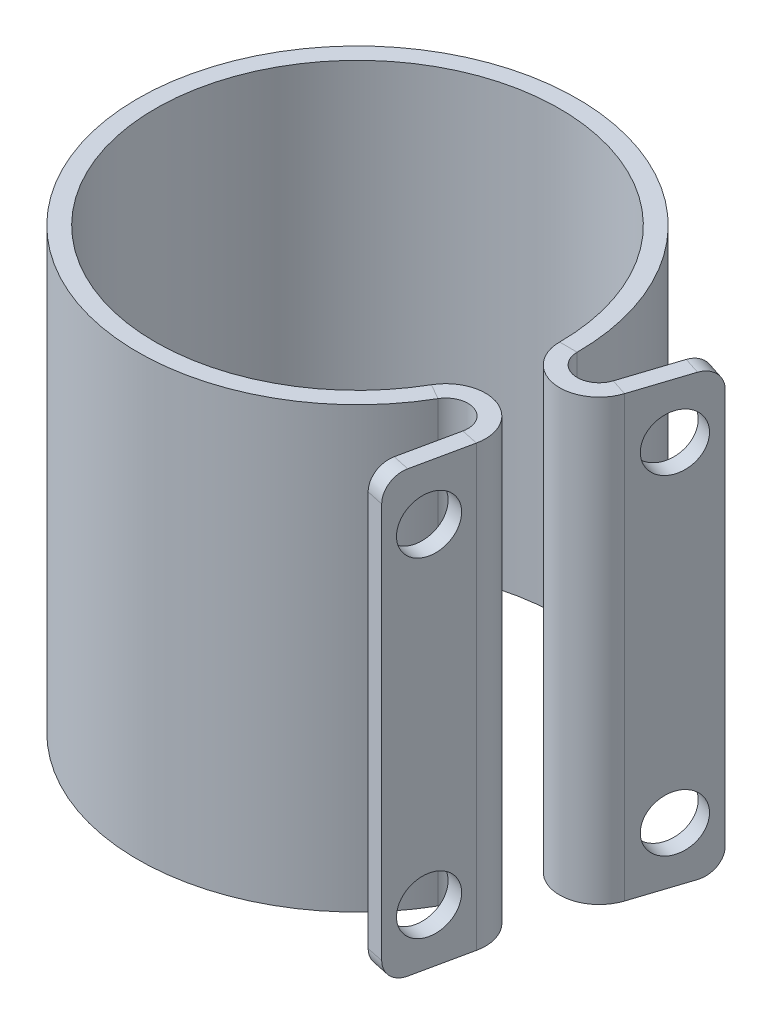
ISO-10303-21;
HEADER;
FILE_DESCRIPTION(('STEP AP214'),'2;1');
FILE_NAME('part.step','',(''),(''),'','','');
FILE_SCHEMA(('AUTOMOTIVE_DESIGN { 1 0 10303 214 1 1 1 1 }'));
ENDSEC;
DATA;
#1=APPLICATION_CONTEXT('core data for automotive mechanical design processes');
#2=APPLICATION_PROTOCOL_DEFINITION('international standard','automotive_design',2000,#1);
#3=PRODUCT_CONTEXT('',#1,'mechanical');
#4=PRODUCT('Part','Part','',(#3));
#5=PRODUCT_RELATED_PRODUCT_CATEGORY('part','',(#4));
#6=PRODUCT_DEFINITION_FORMATION('','',#4);
#7=PRODUCT_DEFINITION_CONTEXT('part definition',#1,'design');
#8=PRODUCT_DEFINITION('design','',#6,#7);
#9=PRODUCT_DEFINITION_SHAPE('','',#8);
#10=(LENGTH_UNIT() NAMED_UNIT(*) SI_UNIT(.MILLI.,.METRE.));
#11=(NAMED_UNIT(*) PLANE_ANGLE_UNIT() SI_UNIT($,.RADIAN.));
#12=(NAMED_UNIT(*) SI_UNIT($,.STERADIAN.) SOLID_ANGLE_UNIT());
#13=UNCERTAINTY_MEASURE_WITH_UNIT(LENGTH_MEASURE(1.E-05),#10,'distance_accuracy_value','');
#14=(GEOMETRIC_REPRESENTATION_CONTEXT(3) GLOBAL_UNCERTAINTY_ASSIGNED_CONTEXT((#13)) GLOBAL_UNIT_ASSIGNED_CONTEXT((#10,
#11,#12)) REPRESENTATION_CONTEXT('',''));
#15=CARTESIAN_POINT('',(0.,0.,0.));
#16=DIRECTION('',(0.,0.,1.));
#17=DIRECTION('',(1.,0.,0.));
#18=AXIS2_PLACEMENT_3D('',#15,#16,#17);
#19=CARTESIAN_POINT('',(0.,40.,0.));
#20=DIRECTION('',(0.,-1.,0.));
#21=DIRECTION('',(1.,0.,0.));
#22=AXIS2_PLACEMENT_3D('',#19,#20,#21);
#23=PLANE('',#22);
#24=DIRECTION('',(0.866025403784445,0.,0.499999999999989));
#25=VECTOR('',#24,1.);
#26=CARTESIAN_POINT('',(7.51812130120628,40.,4.34058935705157));
#27=LINE('',#26,#25);
#28=CARTESIAN_POINT('',(15.9348674296333,39.9999999999999,9.19999999999953));
#29=VERTEX_POINT('',#28);
#30=CARTESIAN_POINT('',(17.3205080756884,39.9999999999999,9.9999999999995));
#31=VERTEX_POINT('',#30);
#32=EDGE_CURVE('E323',#29,#31,#27,.T.);
#33=ORIENTED_EDGE('',*,*,#32,.F.);
#34=CARTESIAN_POINT('',(0.,40.,0.));
#35=DIRECTION('',(0.,1.,0.));
#36=DIRECTION('',(0.,0.,1.));
#37=AXIS2_PLACEMENT_3D('',#34,#35,#36);
#38=CIRCLE('',#37,18.4);
#39=CARTESIAN_POINT('',(18.4,40.,2.28186712493991E-13));
#40=VERTEX_POINT('',#39);
#41=EDGE_CURVE('E291',#40,#29,#38,.T.);
#42=ORIENTED_EDGE('',*,*,#41,.F.);
#43=DIRECTION('',(1.,0.,0.));
#44=VECTOR('',#43,1.);
#45=CARTESIAN_POINT('',(8.68117871410334,40.,1.07274512576502E-13));
#46=LINE('',#45,#44);
#47=CARTESIAN_POINT('',(19.9999999999992,40.,1.23480861347792E-13));
#48=VERTEX_POINT('',#47);
#49=EDGE_CURVE('E320',#40,#48,#46,.T.);
#50=ORIENTED_EDGE('',*,*,#49,.T.);
#51=CARTESIAN_POINT('',(0.,40.,0.));
#52=DIRECTION('',(0.,1.,0.));
#53=DIRECTION('',(0.,0.,1.));
#54=AXIS2_PLACEMENT_3D('',#51,#52,#53);
#55=CIRCLE('',#54,20.);
#56=EDGE_CURVE('E304',#48,#31,#55,.T.);
#57=ORIENTED_EDGE('',*,*,#56,.T.);
#58=EDGE_LOOP('',(#33,#42,#50,#57));
#59=FACE_BOUND('',#58,.T.);
#60=ADVANCED_FACE('F77',(#59),#23,.F.);
#61=CARTESIAN_POINT('',(0.,0.,0.));
#62=DIRECTION('',(0.,1.,0.));
#63=DIRECTION('',(-1.,0.,0.));
#64=AXIS2_PLACEMENT_3D('',#61,#62,#63);
#65=PLANE('',#64);
#66=CARTESIAN_POINT('',(0.,0.,0.));
#67=DIRECTION('',(0.,1.,0.));
#68=DIRECTION('',(0.,0.,1.));
#69=AXIS2_PLACEMENT_3D('',#66,#67,#68);
#70=CIRCLE('',#69,18.4);
#71=CARTESIAN_POINT('',(15.9348674296338,0.,9.1999999999998));
#72=VERTEX_POINT('',#71);
#73=CARTESIAN_POINT('',(18.4000000000005,-2.11875548486438E-13,0.));
#74=VERTEX_POINT('',#73);
#75=EDGE_CURVE('E314',#72,#74,#70,.F.);
#76=ORIENTED_EDGE('',*,*,#75,.F.);
#77=DIRECTION('',(0.866025403784445,0.,0.499999999999989));
#78=VECTOR('',#77,1.);
#79=CARTESIAN_POINT('',(7.51812130120627,0.,4.34058935705157));
#80=LINE('',#79,#78);
#81=CARTESIAN_POINT('',(17.3205080756889,0.,9.99999999999982));
#82=VERTEX_POINT('',#81);
#83=EDGE_CURVE('E325',#72,#82,#80,.T.);
#84=ORIENTED_EDGE('',*,*,#83,.T.);
#85=CARTESIAN_POINT('',(0.,0.,0.));
#86=DIRECTION('',(0.,1.,0.));
#87=DIRECTION('',(0.,0.,1.));
#88=AXIS2_PLACEMENT_3D('',#85,#86,#87);
#89=CIRCLE('',#88,20.);
#90=CARTESIAN_POINT('',(20.0000000000005,-1.5920628492124E-13,1.20232345914083E-13));
#91=VERTEX_POINT('',#90);
#92=EDGE_CURVE('E303',#82,#91,#89,.F.);
#93=ORIENTED_EDGE('',*,*,#92,.T.);
#94=DIRECTION('',(1.,0.,0.));
#95=VECTOR('',#94,1.);
#96=CARTESIAN_POINT('',(8.68117871410334,0.,0.));
#97=LINE('',#96,#95);
#98=EDGE_CURVE('E302',#74,#91,#97,.T.);
#99=ORIENTED_EDGE('',*,*,#98,.F.);
#100=EDGE_LOOP('',(#76,#84,#93,#99));
#101=FACE_BOUND('',#100,.T.);
#102=ADVANCED_FACE('F408',(#101),#65,.F.);
#103=CARTESIAN_POINT('',(0.,-65.1239131548889,0.));
#104=DIRECTION('',(0.,1.,0.));
#105=DIRECTION('',(0.,0.,1.));
#106=AXIS2_PLACEMENT_3D('',#103,#104,#105);
#107=CYLINDRICAL_SURFACE('',#106,20.);
#108=DIRECTION('',(0.,1.,0.));
#109=VECTOR('',#108,1.);
#110=CARTESIAN_POINT('',(20.,-65.1239131548889,2.4350272693589E-13));
#111=LINE('',#110,#109);
#112=EDGE_CURVE('E300',#91,#48,#111,.T.);
#113=ORIENTED_EDGE('',*,*,#112,.F.);
#114=ORIENTED_EDGE('',*,*,#92,.F.);
#115=DIRECTION('',(0.,1.,0.));
#116=VECTOR('',#115,1.);
#117=CARTESIAN_POINT('',(17.3205080756889,-65.1239131548889,9.99999999999977));
#118=LINE('',#117,#116);
#119=EDGE_CURVE('E307',#31,#82,#118,.F.);
#120=ORIENTED_EDGE('',*,*,#119,.F.);
#121=ORIENTED_EDGE('',*,*,#56,.F.);
#122=EDGE_LOOP('',(#113,#114,#120,#121));
#123=FACE_BOUND('',#122,.T.);
#124=ADVANCED_FACE('F396',(#123),#107,.T.);
#125=CARTESIAN_POINT('',(0.,-65.1239131548889,0.));
#126=DIRECTION('',(0.,1.,0.));
#127=DIRECTION('',(0.,0.,1.));
#128=AXIS2_PLACEMENT_3D('',#125,#126,#127);
#129=CYLINDRICAL_SURFACE('',#128,18.4);
#130=DIRECTION('',(0.,1.,0.));
#131=VECTOR('',#130,1.);
#132=CARTESIAN_POINT('',(18.4,-65.1239131548889,2.23154287222795E-13));
#133=LINE('',#132,#131);
#134=EDGE_CURVE('E308',#74,#40,#133,.T.);
#135=ORIENTED_EDGE('',*,*,#134,.T.);
#136=ORIENTED_EDGE('',*,*,#41,.T.);
#137=DIRECTION('',(0.,1.,0.));
#138=VECTOR('',#137,1.);
#139=CARTESIAN_POINT('',(15.9348674296338,-65.1239131548889,9.19999999999979));
#140=LINE('',#139,#138);
#141=EDGE_CURVE('E200',#29,#72,#140,.F.);
#142=ORIENTED_EDGE('',*,*,#141,.T.);
#143=ORIENTED_EDGE('',*,*,#75,.T.);
#144=EDGE_LOOP('',(#135,#136,#142,#143));
#145=FACE_BOUND('',#144,.T.);
#146=ADVANCED_FACE('F410',(#145),#129,.F.);
#147=CARTESIAN_POINT('',(21.9999999999996,40.,1.48904968611713E-13));
#148=DIRECTION('',(0.,1.,0.));
#149=DIRECTION('',(-1.,0.,0.));
#150=AXIS2_PLACEMENT_3D('',#147,#148,#149);
#151=PLANE('',#150);
#152=DIRECTION('',(-0.951056516295146,0.,-0.309016994374971));
#153=VECTOR('',#152,1.);
#154=CARTESIAN_POINT('',(25.4238034586625,40.,1.11246117975017));
#155=LINE('',#154,#153);
#156=CARTESIAN_POINT('',(23.9021130325903,40.0000000000001,0.618033988750215));
#157=VERTEX_POINT('',#156);
#158=CARTESIAN_POINT('',(25.4238034586625,40.0000000000002,1.11246117975017));
#159=VERTEX_POINT('',#158);
#160=EDGE_CURVE('E261',#157,#159,#155,.F.);
#161=ORIENTED_EDGE('',*,*,#160,.F.);
#162=CARTESIAN_POINT('',(21.9999999999996,40.,1.48904968611713E-13));
#163=DIRECTION('',(0.,-1.,0.));
#164=DIRECTION('',(1.,0.,0.));
#165=AXIS2_PLACEMENT_3D('',#162,#163,#164);
#166=CIRCLE('',#165,2.0000000000004);
#167=EDGE_CURVE('E295',#48,#157,#166,.F.);
#168=ORIENTED_EDGE('',*,*,#167,.F.);
#169=ORIENTED_EDGE('',*,*,#49,.F.);
#170=CARTESIAN_POINT('',(21.9999999999996,40.,1.48904968611713E-13));
#171=DIRECTION('',(0.,-1.,0.));
#172=DIRECTION('',(1.,0.,0.));
#173=AXIS2_PLACEMENT_3D('',#170,#171,#172);
#174=CIRCLE('',#173,3.60000000000039);
#175=EDGE_CURVE('E288',#40,#159,#174,.F.);
#176=ORIENTED_EDGE('',*,*,#175,.T.);
#177=EDGE_LOOP('',(#161,#168,#169,#176));
#178=FACE_BOUND('',#177,.T.);
#179=ADVANCED_FACE('F382',(#178),#151,.T.);
#180=CARTESIAN_POINT('',(22.0000000000009,0.,1.45656453178004E-13));
#181=DIRECTION('',(0.,1.,0.));
#182=DIRECTION('',(-1.,0.,0.));
#183=AXIS2_PLACEMENT_3D('',#180,#181,#182);
#184=PLANE('',#183);
#185=CARTESIAN_POINT('',(22.0000000000009,0.,1.45656453178004E-13));
#186=DIRECTION('',(0.,-1.,0.));
#187=DIRECTION('',(1.,0.,0.));
#188=AXIS2_PLACEMENT_3D('',#185,#186,#187);
#189=CIRCLE('',#188,2.0000000000004);
#190=CARTESIAN_POINT('',(23.9021130325916,0.,0.618033988750211));
#191=VERTEX_POINT('',#190);
#192=EDGE_CURVE('E266',#191,#91,#189,.T.);
#193=ORIENTED_EDGE('',*,*,#192,.F.);
#194=DIRECTION('',(-0.951056516295146,0.,-0.309016994374971));
#195=VECTOR('',#194,1.);
#196=CARTESIAN_POINT('',(23.9021130325903,0.,0.6180339887498));
#197=LINE('',#196,#195);
#198=CARTESIAN_POINT('',(25.4238034586626,0.,1.11246117974975));
#199=VERTEX_POINT('',#198);
#200=EDGE_CURVE('E281',#191,#199,#197,.F.);
#201=ORIENTED_EDGE('',*,*,#200,.T.);
#202=CARTESIAN_POINT('',(22.0000000000009,0.,1.45656453178004E-13));
#203=DIRECTION('',(0.,-1.,0.));
#204=DIRECTION('',(1.,0.,0.));
#205=AXIS2_PLACEMENT_3D('',#202,#203,#204);
#206=CIRCLE('',#205,3.60000000000039);
#207=EDGE_CURVE('E292',#199,#74,#206,.T.);
#208=ORIENTED_EDGE('',*,*,#207,.T.);
#209=ORIENTED_EDGE('',*,*,#98,.T.);
#210=EDGE_LOOP('',(#193,#201,#208,#209));
#211=FACE_BOUND('',#210,.T.);
#212=ADVANCED_FACE('F375',(#211),#184,.F.);
#213=CARTESIAN_POINT('',(22.0000000000009,0.,1.45656453178004E-13));
#214=DIRECTION('',(0.,-1.,0.));
#215=DIRECTION('',(0.951056516295146,0.,0.309016994374971));
#216=AXIS2_PLACEMENT_3D('',#213,#214,#215);
#217=CYLINDRICAL_SURFACE('',#216,3.60000000000039);
#218=ORIENTED_EDGE('',*,*,#134,.F.);
#219=ORIENTED_EDGE('',*,*,#207,.F.);
#220=DIRECTION('',(0.,-1.,0.));
#221=VECTOR('',#220,1.);
#222=CARTESIAN_POINT('',(25.4238034586625,40.,1.11246117975017));
#223=LINE('',#222,#221);
#224=EDGE_CURVE('E278',#199,#159,#223,.F.);
#225=ORIENTED_EDGE('',*,*,#224,.T.);
#226=ORIENTED_EDGE('',*,*,#175,.F.);
#227=EDGE_LOOP('',(#218,#219,#225,#226));
#228=FACE_BOUND('',#227,.T.);
#229=ADVANCED_FACE('F378',(#228),#217,.T.);
#230=CARTESIAN_POINT('',(22.0000000000009,0.,1.45656453178004E-13));
#231=DIRECTION('',(0.,-1.,0.));
#232=DIRECTION('',(0.951056516295146,0.,0.309016994374971));
#233=AXIS2_PLACEMENT_3D('',#230,#231,#232);
#234=CYLINDRICAL_SURFACE('',#233,2.0000000000004);
#235=ORIENTED_EDGE('',*,*,#112,.T.);
#236=ORIENTED_EDGE('',*,*,#167,.T.);
#237=DIRECTION('',(0.,-1.,0.));
#238=VECTOR('',#237,1.);
#239=CARTESIAN_POINT('',(23.9021130325903,40.,0.618033988750215));
#240=LINE('',#239,#238);
#241=EDGE_CURVE('E284',#157,#191,#240,.T.);
#242=ORIENTED_EDGE('',*,*,#241,.T.);
#243=ORIENTED_EDGE('',*,*,#192,.T.);
#244=EDGE_LOOP('',(#235,#236,#242,#243));
#245=FACE_BOUND('',#244,.T.);
#246=ADVANCED_FACE('F390',(#245),#234,.F.);
#247=CARTESIAN_POINT('',(27.6705098312489,0.,-5.80219003602524));
#248=DIRECTION('',(0.,1.,0.));
#249=DIRECTION('',(0.,0.,1.));
#250=AXIS2_PLACEMENT_3D('',#247,#248,#249);
#251=PLANE('',#250);
#252=DIRECTION('',(-0.309016994374971,0.,0.951056516295146));
#253=VECTOR('',#252,1.);
#254=CARTESIAN_POINT('',(26.1488194051766,0.,-6.29661722702519));
#255=LINE('',#254,#253);
#256=CARTESIAN_POINT('',(25.5307854164267,0.,-4.3945041944349));
#257=VERTEX_POINT('',#256);
#258=EDGE_CURVE('E276',#191,#257,#255,.F.);
#259=ORIENTED_EDGE('',*,*,#258,.T.);
#260=DIRECTION('',(-0.951056516295146,0.,-0.309016994374971));
#261=VECTOR('',#260,1.);
#262=CARTESIAN_POINT('',(27.0524758424989,0.,-3.90007700343494));
#263=LINE('',#262,#261);
#264=CARTESIAN_POINT('',(27.0524758424989,0.,-3.90007700343495));
#265=VERTEX_POINT('',#264);
#266=EDGE_CURVE('E100',#257,#265,#263,.F.);
#267=ORIENTED_EDGE('',*,*,#266,.T.);
#268=DIRECTION('',(0.309016994374971,0.,-0.951056516295146));
#269=VECTOR('',#268,1.);
#270=CARTESIAN_POINT('',(19.6118603698212,-1.46861802455309E-13,18.9997827432746));
#271=LINE('',#270,#269);
#272=EDGE_CURVE('E269',#199,#265,#271,.T.);
#273=ORIENTED_EDGE('',*,*,#272,.F.);
#274=ORIENTED_EDGE('',*,*,#200,.F.);
#275=EDGE_LOOP('',(#259,#267,#273,#274));
#276=FACE_BOUND('',#275,.T.);
#277=ADVANCED_FACE('F372',(#276),#251,.F.);
#278=CARTESIAN_POINT('',(21.5216904260721,39.9999999999999,13.1219302203497));
#279=DIRECTION('',(0.,-1.,0.));
#280=DIRECTION('',(0.,0.,-1.));
#281=AXIS2_PLACEMENT_3D('',#278,#279,#280);
#282=PLANE('',#281);
#283=DIRECTION('',(-0.309016994374971,0.,0.951056516295146));
#284=VECTOR('',#283,1.);
#285=CARTESIAN_POINT('',(19.6118603698212,39.9999999999999,18.9997827432749));
#286=LINE('',#285,#284);
#287=CARTESIAN_POINT('',(27.0524758424989,40.,-3.9000770034347));
#288=VERTEX_POINT('',#287);
#289=EDGE_CURVE('E264',#288,#159,#286,.T.);
#290=ORIENTED_EDGE('',*,*,#289,.F.);
#291=DIRECTION('',(-0.951056516295146,0.,-0.309016994374971));
#292=VECTOR('',#291,1.);
#293=CARTESIAN_POINT('',(27.0524758424989,40.,-3.9000770034347));
#294=LINE('',#293,#292);
#295=CARTESIAN_POINT('',(25.5307854164267,40.,-4.39450419443465));
#296=VERTEX_POINT('',#295);
#297=EDGE_CURVE('E13',#288,#296,#294,.T.);
#298=ORIENTED_EDGE('',*,*,#297,.T.);
#299=DIRECTION('',(0.309016994374971,0.,-0.951056516295146));
#300=VECTOR('',#299,1.);
#301=CARTESIAN_POINT('',(19.9999999999998,39.9999999999999,12.6275030293498));
#302=LINE('',#301,#300);
#303=EDGE_CURVE('E271',#296,#157,#302,.F.);
#304=ORIENTED_EDGE('',*,*,#303,.T.);
#305=ORIENTED_EDGE('',*,*,#160,.T.);
#306=EDGE_LOOP('',(#290,#298,#304,#305));
#307=FACE_BOUND('',#306,.T.);
#308=ADVANCED_FACE('F386',(#307),#282,.F.);
#309=CARTESIAN_POINT('',(19.6118603698212,-1.19774347539132E-13,18.9997827432746));
#310=DIRECTION('',(-0.951056516295146,0.,-0.309016994374971));
#311=DIRECTION('',(-0.309016994374971,0.,0.951056516295146));
#312=AXIS2_PLACEMENT_3D('',#309,#310,#311);
#313=PLANE('',#312);
#314=CARTESIAN_POINT('',(26.5471566449556,4.99999999999997,-2.34486442813742));
#315=DIRECTION('',(-0.951056516295147,0.,-0.309016994374969));
#316=DIRECTION('',(0.309016994374969,0.,-0.951056516295147));
#317=AXIS2_PLACEMENT_3D('',#314,#315,#316);
#318=CIRCLE('',#317,2.5);
#319=CARTESIAN_POINT('',(27.319699130893,4.99999999999997,-4.72250571887529));
#320=VERTEX_POINT('',#319);
#321=EDGE_CURVE('E254',#320,#320,#318,.T.);
#322=ORIENTED_EDGE('',*,*,#321,.T.);
#323=EDGE_LOOP('',(#322));
#324=FACE_BOUND('',#323,.T.);
#325=CARTESIAN_POINT('',(26.5471566449556,35.,-2.34486442813742));
#326=DIRECTION('',(0.951056516295147,0.,0.309016994374969));
#327=DIRECTION('',(0.309016994374969,0.,-0.951056516295147));
#328=AXIS2_PLACEMENT_3D('',#325,#326,#327);
#329=CIRCLE('',#328,2.5);
#330=CARTESIAN_POINT('',(27.319699130893,35.,-4.72250571887529));
#331=VERTEX_POINT('',#330);
#332=EDGE_CURVE('E257',#331,#331,#329,.T.);
#333=ORIENTED_EDGE('',*,*,#332,.F.);
#334=EDGE_LOOP('',(#333));
#335=FACE_BOUND('',#334,.T.);
#336=ORIENTED_EDGE('',*,*,#272,.T.);
#337=CARTESIAN_POINT('',(27.0524758424989,1.99999999999999,-3.90007700343493));
#338=DIRECTION('',(-0.951056516295146,0.,-0.309016994374971));
#339=DIRECTION('',(-0.309016994374971,0.,0.951056516295146));
#340=AXIS2_PLACEMENT_3D('',#337,#338,#339);
#341=CIRCLE('',#340,2.);
#342=CARTESIAN_POINT('',(27.6705098312489,2.00000000000001,-5.80219003602522));
#343=VERTEX_POINT('',#342);
#344=EDGE_CURVE('E85',#265,#343,#341,.F.);
#345=ORIENTED_EDGE('',*,*,#344,.T.);
#346=DIRECTION('',(0.,1.,0.));
#347=VECTOR('',#346,1.);
#348=CARTESIAN_POINT('',(27.6705098312489,0.,-5.80219003602524));
#349=LINE('',#348,#347);
#350=CARTESIAN_POINT('',(27.6705098312489,38.,-5.802190036025));
#351=VERTEX_POINT('',#350);
#352=EDGE_CURVE('E267',#343,#351,#349,.T.);
#353=ORIENTED_EDGE('',*,*,#352,.T.);
#354=CARTESIAN_POINT('',(27.0524758424989,38.,-3.90007700343471));
#355=DIRECTION('',(-0.951056516295146,0.,-0.309016994374971));
#356=DIRECTION('',(-0.309016994374971,0.,0.951056516295146));
#357=AXIS2_PLACEMENT_3D('',#354,#355,#356);
#358=CIRCLE('',#357,2.);
#359=EDGE_CURVE('E92',#351,#288,#358,.F.);
#360=ORIENTED_EDGE('',*,*,#359,.T.);
#361=ORIENTED_EDGE('',*,*,#289,.T.);
#362=ORIENTED_EDGE('',*,*,#224,.F.);
#363=EDGE_LOOP('',(#336,#345,#353,#360,#361,#362));
#364=FACE_BOUND('',#363,.T.);
#365=ADVANCED_FACE('F358',(#324,#335,#364),#313,.F.);
#366=CARTESIAN_POINT('',(18.090169943749,-1.16657485888249E-13,18.5053555522747));
#367=DIRECTION('',(-0.951056516295146,0.,-0.309016994374971));
#368=DIRECTION('',(-0.309016994374971,0.,0.951056516295146));
#369=AXIS2_PLACEMENT_3D('',#366,#367,#368);
#370=PLANE('',#369);
#371=CARTESIAN_POINT('',(25.0254662188834,4.99999999999997,-2.83929161913737));
#372=DIRECTION('',(-0.951056516295146,0.,-0.309016994374971));
#373=DIRECTION('',(-0.309016994374971,0.,0.951056516295146));
#374=AXIS2_PLACEMENT_3D('',#371,#372,#373);
#375=CIRCLE('',#374,2.5);
#376=CARTESIAN_POINT('',(24.252923732946,4.99999999999997,-0.461650328399509));
#377=VERTEX_POINT('',#376);
#378=EDGE_CURVE('E247',#377,#377,#375,.T.);
#379=ORIENTED_EDGE('',*,*,#378,.F.);
#380=EDGE_LOOP('',(#379));
#381=FACE_BOUND('',#380,.T.);
#382=CARTESIAN_POINT('',(25.0254662188834,35.,-2.83929161913736));
#383=DIRECTION('',(-0.951056516295146,0.,-0.309016994374971));
#384=DIRECTION('',(-0.309016994374971,0.,0.951056516295146));
#385=AXIS2_PLACEMENT_3D('',#382,#383,#384);
#386=CIRCLE('',#385,2.5);
#387=CARTESIAN_POINT('',(24.252923732946,35.,-0.461650328399492));
#388=VERTEX_POINT('',#387);
#389=EDGE_CURVE('E258',#388,#388,#386,.F.);
#390=ORIENTED_EDGE('',*,*,#389,.T.);
#391=EDGE_LOOP('',(#390));
#392=FACE_BOUND('',#391,.T.);
#393=DIRECTION('',(0.,-1.,0.));
#394=VECTOR('',#393,1.);
#395=CARTESIAN_POINT('',(26.1488194051766,40.,-6.29661722702494));
#396=LINE('',#395,#394);
#397=CARTESIAN_POINT('',(26.1488194051766,2.00000000000001,-6.29661722702518));
#398=VERTEX_POINT('',#397);
#399=CARTESIAN_POINT('',(26.1488194051766,38.,-6.29661722702495));
#400=VERTEX_POINT('',#399);
#401=EDGE_CURVE('E273',#398,#400,#396,.F.);
#402=ORIENTED_EDGE('',*,*,#401,.F.);
#403=CARTESIAN_POINT('',(25.5307854164267,2.,-4.39450419443489));
#404=DIRECTION('',(-0.951056516295146,0.,-0.309016994374971));
#405=DIRECTION('',(-0.309016994374971,0.,0.951056516295146));
#406=AXIS2_PLACEMENT_3D('',#403,#404,#405);
#407=CIRCLE('',#406,2.);
#408=EDGE_CURVE('E353',#398,#257,#407,.T.);
#409=ORIENTED_EDGE('',*,*,#408,.T.);
#410=ORIENTED_EDGE('',*,*,#258,.F.);
#411=ORIENTED_EDGE('',*,*,#241,.F.);
#412=ORIENTED_EDGE('',*,*,#303,.F.);
#413=CARTESIAN_POINT('',(25.5307854164267,38.,-4.39450419443466));
#414=DIRECTION('',(-0.951056516295146,0.,-0.309016994374971));
#415=DIRECTION('',(-0.309016994374971,0.,0.951056516295146));
#416=AXIS2_PLACEMENT_3D('',#413,#414,#415);
#417=CIRCLE('',#416,2.);
#418=EDGE_CURVE('E351',#296,#400,#417,.T.);
#419=ORIENTED_EDGE('',*,*,#418,.T.);
#420=EDGE_LOOP('',(#402,#409,#410,#411,#412,#419));
#421=FACE_BOUND('',#420,.T.);
#422=ADVANCED_FACE('F369',(#381,#392,#421),#370,.T.);
#423=CARTESIAN_POINT('',(27.6705098312489,40.,-5.80219003602498));
#424=DIRECTION('',(-0.309016994374971,0.,0.951056516295146));
#425=DIRECTION('',(0.951056516295146,0.,0.309016994374971));
#426=AXIS2_PLACEMENT_3D('',#423,#424,#425);
#427=PLANE('',#426);
#428=ORIENTED_EDGE('',*,*,#352,.F.);
#429=DIRECTION('',(-0.951056516295146,0.,-0.309016994374971));
#430=VECTOR('',#429,1.);
#431=CARTESIAN_POINT('',(27.6705098312489,2.00000000000001,-5.80219003602522));
#432=LINE('',#431,#430);
#433=EDGE_CURVE('E348',#343,#398,#432,.T.);
#434=ORIENTED_EDGE('',*,*,#433,.T.);
#435=ORIENTED_EDGE('',*,*,#401,.T.);
#436=DIRECTION('',(-0.951056516295146,0.,-0.309016994374971));
#437=VECTOR('',#436,1.);
#438=CARTESIAN_POINT('',(27.6705098312489,38.,-5.802190036025));
#439=LINE('',#438,#437);
#440=EDGE_CURVE('E346',#400,#351,#439,.F.);
#441=ORIENTED_EDGE('',*,*,#440,.T.);
#442=EDGE_LOOP('',(#428,#434,#435,#441));
#443=FACE_BOUND('',#442,.T.);
#444=ADVANCED_FACE('F363',(#443),#427,.F.);
#445=CARTESIAN_POINT('',(-20.7450546196287,35.0000000000001,-17.7110353464098));
#446=DIRECTION('',(0.951056516295147,0.,0.309016994374969));
#447=DIRECTION('',(0.309016994374969,0.,-0.951056516295147));
#448=AXIS2_PLACEMENT_3D('',#445,#446,#447);
#449=CYLINDRICAL_SURFACE('',#448,2.5);
#450=ORIENTED_EDGE('',*,*,#389,.F.);
#451=EDGE_LOOP('',(#450));
#452=FACE_BOUND('',#451,.T.);
#453=ORIENTED_EDGE('',*,*,#332,.T.);
#454=EDGE_LOOP('',(#453));
#455=FACE_BOUND('',#454,.T.);
#456=ADVANCED_FACE('F525',(#452,#455),#449,.F.);
#457=CARTESIAN_POINT('',(-20.7450546196287,4.9999999999999,-17.7110353464098));
#458=DIRECTION('',(0.951056516295147,0.,0.309016994374969));
#459=DIRECTION('',(0.309016994374969,0.,-0.951056516295147));
#460=AXIS2_PLACEMENT_3D('',#457,#458,#459);
#461=CYLINDRICAL_SURFACE('',#460,2.5);
#462=ORIENTED_EDGE('',*,*,#378,.T.);
#463=EDGE_LOOP('',(#462));
#464=FACE_BOUND('',#463,.T.);
#465=ORIENTED_EDGE('',*,*,#321,.F.);
#466=EDGE_LOOP('',(#465));
#467=FACE_BOUND('',#466,.T.);
#468=ADVANCED_FACE('F617',(#464,#467),#461,.F.);
#469=CARTESIAN_POINT('',(19.0525588832578,0.,10.9999999999998));
#470=DIRECTION('',(0.,-1.,0.));
#471=DIRECTION('',(1.,0.,0.));
#472=AXIS2_PLACEMENT_3D('',#469,#470,#471);
#473=PLANE('',#472);
#474=DIRECTION('',(-0.978147600733811,0.,-0.207911690817735));
#475=VECTOR('',#474,1.);
#476=CARTESIAN_POINT('',(22.5738902458995,0.,11.7484820869436));
#477=LINE('',#476,#475);
#478=CARTESIAN_POINT('',(21.0088540847254,0.,11.4158233816352));
#479=VERTEX_POINT('',#478);
#480=CARTESIAN_POINT('',(22.5738902458995,0.,11.7484820869436));
#481=VERTEX_POINT('',#480);
#482=EDGE_CURVE('E243',#479,#481,#477,.F.);
#483=ORIENTED_EDGE('',*,*,#482,.F.);
#484=CARTESIAN_POINT('',(19.0525588832578,0.,10.9999999999998));
#485=DIRECTION('',(0.,1.,0.));
#486=DIRECTION('',(-1.,0.,0.));
#487=AXIS2_PLACEMENT_3D('',#484,#485,#486);
#488=CIRCLE('',#487,1.99999999999996);
#489=EDGE_CURVE('E204',#82,#479,#488,.F.);
#490=ORIENTED_EDGE('',*,*,#489,.F.);
#491=ORIENTED_EDGE('',*,*,#83,.F.);
#492=CARTESIAN_POINT('',(19.0525588832578,0.,10.9999999999998));
#493=DIRECTION('',(0.,1.,0.));
#494=DIRECTION('',(-1.,0.,0.));
#495=AXIS2_PLACEMENT_3D('',#492,#493,#494);
#496=CIRCLE('',#495,3.59999999999995);
#497=EDGE_CURVE('E203',#72,#481,#496,.F.);
#498=ORIENTED_EDGE('',*,*,#497,.T.);
#499=EDGE_LOOP('',(#483,#490,#491,#498));
#500=FACE_BOUND('',#499,.T.);
#501=ADVANCED_FACE('F405',(#500),#473,.T.);
#502=CARTESIAN_POINT('',(19.0525588832573,40.,10.9999999999995));
#503=DIRECTION('',(0.,-1.,0.));
#504=DIRECTION('',(1.,0.,0.));
#505=AXIS2_PLACEMENT_3D('',#502,#503,#504);
#506=PLANE('',#505);
#507=CARTESIAN_POINT('',(19.0525588832573,40.,10.9999999999995));
#508=DIRECTION('',(0.,1.,0.));
#509=DIRECTION('',(-1.,0.,0.));
#510=AXIS2_PLACEMENT_3D('',#507,#508,#509);
#511=CIRCLE('',#510,1.99999999999996);
#512=CARTESIAN_POINT('',(21.0088540847249,40.,11.4158233816349));
#513=VERTEX_POINT('',#512);
#514=EDGE_CURVE('E211',#513,#31,#511,.T.);
#515=ORIENTED_EDGE('',*,*,#514,.F.);
#516=DIRECTION('',(-0.978147600733811,0.,-0.207911690817735));
#517=VECTOR('',#516,1.);
#518=CARTESIAN_POINT('',(21.0088540847254,40.,11.415823381635));
#519=LINE('',#518,#517);
#520=CARTESIAN_POINT('',(22.5738902458995,40.,11.7484820869434));
#521=VERTEX_POINT('',#520);
#522=EDGE_CURVE('E208',#513,#521,#519,.F.);
#523=ORIENTED_EDGE('',*,*,#522,.T.);
#524=CARTESIAN_POINT('',(19.0525588832573,40.,10.9999999999995));
#525=DIRECTION('',(0.,1.,0.));
#526=DIRECTION('',(-1.,0.,0.));
#527=AXIS2_PLACEMENT_3D('',#524,#525,#526);
#528=CIRCLE('',#527,3.59999999999995);
#529=EDGE_CURVE('E193',#521,#29,#528,.T.);
#530=ORIENTED_EDGE('',*,*,#529,.T.);
#531=ORIENTED_EDGE('',*,*,#32,.T.);
#532=EDGE_LOOP('',(#515,#523,#530,#531));
#533=FACE_BOUND('',#532,.T.);
#534=ADVANCED_FACE('F209',(#533),#506,.F.);
#535=CARTESIAN_POINT('',(19.0525588832573,40.,10.9999999999995));
#536=DIRECTION('',(0.,1.,0.));
#537=DIRECTION('',(0.978147600733811,0.,0.207911690817735));
#538=AXIS2_PLACEMENT_3D('',#535,#536,#537);
#539=CYLINDRICAL_SURFACE('',#538,3.59999999999995);
#540=ORIENTED_EDGE('',*,*,#141,.F.);
#541=ORIENTED_EDGE('',*,*,#529,.F.);
#542=DIRECTION('',(0.,1.,0.));
#543=VECTOR('',#542,1.);
#544=CARTESIAN_POINT('',(22.5738902458995,0.,11.7484820869436));
#545=LINE('',#544,#543);
#546=EDGE_CURVE('E197',#521,#481,#545,.F.);
#547=ORIENTED_EDGE('',*,*,#546,.T.);
#548=ORIENTED_EDGE('',*,*,#497,.F.);
#549=EDGE_LOOP('',(#540,#541,#547,#548));
#550=FACE_BOUND('',#549,.T.);
#551=ADVANCED_FACE('F195',(#550),#539,.T.);
#552=CARTESIAN_POINT('',(19.0525588832573,40.,10.9999999999995));
#553=DIRECTION('',(0.,1.,0.));
#554=DIRECTION('',(0.978147600733811,0.,0.207911690817735));
#555=AXIS2_PLACEMENT_3D('',#552,#553,#554);
#556=CYLINDRICAL_SURFACE('',#555,1.99999999999996);
#557=ORIENTED_EDGE('',*,*,#119,.T.);
#558=ORIENTED_EDGE('',*,*,#489,.T.);
#559=DIRECTION('',(0.,1.,0.));
#560=VECTOR('',#559,1.);
#561=CARTESIAN_POINT('',(21.0088540847254,0.,11.4158233816352));
#562=LINE('',#561,#560);
#563=EDGE_CURVE('E216',#479,#513,#562,.T.);
#564=ORIENTED_EDGE('',*,*,#563,.T.);
#565=ORIENTED_EDGE('',*,*,#514,.T.);
#566=EDGE_LOOP('',(#557,#558,#564,#565));
#567=FACE_BOUND('',#566,.T.);
#568=ADVANCED_FACE('F400',(#567),#556,.F.);
#569=CARTESIAN_POINT('',(21.0622694315161,40.,18.860098884407));
#570=DIRECTION('',(0.,-1.,0.));
#571=DIRECTION('',(0.,0.,-1.));
#572=AXIS2_PLACEMENT_3D('',#569,#570,#571);
#573=PLANE('',#572);
#574=DIRECTION('',(0.207911690817735,0.,-0.978147600733811));
#575=VECTOR('',#574,1.);
#576=CARTESIAN_POINT('',(19.497233270342,40.,18.5274401790986));
#577=LINE('',#576,#575);
#578=CARTESIAN_POINT('',(19.9130566519774,40.,16.571144977631));
#579=VERTEX_POINT('',#578);
#580=EDGE_CURVE('E225',#513,#579,#577,.F.);
#581=ORIENTED_EDGE('',*,*,#580,.T.);
#582=DIRECTION('',(-0.978147600733811,0.,-0.207911690817735));
#583=VECTOR('',#582,1.);
#584=CARTESIAN_POINT('',(21.4780928131515,40.,16.9038036829394));
#585=LINE('',#584,#583);
#586=CARTESIAN_POINT('',(21.4780928131515,40.,16.9038036829394));
#587=VERTEX_POINT('',#586);
#588=EDGE_CURVE('E229',#579,#587,#585,.F.);
#589=ORIENTED_EDGE('',*,*,#588,.T.);
#590=DIRECTION('',(-0.207911690817735,0.,0.978147600733811));
#591=VECTOR('',#590,1.);
#592=CARTESIAN_POINT('',(26.4842606673759,40.,-6.64836433715036));
#593=LINE('',#592,#591);
#594=EDGE_CURVE('E221',#521,#587,#593,.T.);
#595=ORIENTED_EDGE('',*,*,#594,.F.);
#596=ORIENTED_EDGE('',*,*,#522,.F.);
#597=EDGE_LOOP('',(#581,#589,#595,#596));
#598=FACE_BOUND('',#597,.T.);
#599=ADVANCED_FACE('F227',(#598),#573,.F.);
#600=CARTESIAN_POINT('',(25.1992957515376,0.,-0.603079704473557));
#601=DIRECTION('',(0.,1.,0.));
#602=DIRECTION('',(0.,0.,1.));
#603=AXIS2_PLACEMENT_3D('',#600,#601,#602);
#604=PLANE('',#603);
#605=DIRECTION('',(0.207911690817735,0.,-0.978147600733811));
#606=VECTOR('',#605,1.);
#607=CARTESIAN_POINT('',(26.4842606673759,0.,-6.64836433715035));
#608=LINE('',#607,#606);
#609=CARTESIAN_POINT('',(21.4780928131515,0.,16.9038036829394));
#610=VERTEX_POINT('',#609);
#611=EDGE_CURVE('E224',#610,#481,#608,.T.);
#612=ORIENTED_EDGE('',*,*,#611,.F.);
#613=DIRECTION('',(-0.978147600733811,0.,-0.207911690817735));
#614=VECTOR('',#613,1.);
#615=CARTESIAN_POINT('',(21.4780928131515,0.,16.9038036829394));
#616=LINE('',#615,#614);
#617=CARTESIAN_POINT('',(19.9130566519774,0.,16.571144977631));
#618=VERTEX_POINT('',#617);
#619=EDGE_CURVE('E343',#610,#618,#616,.T.);
#620=ORIENTED_EDGE('',*,*,#619,.T.);
#621=DIRECTION('',(-0.207911690817735,0.,0.978147600733811));
#622=VECTOR('',#621,1.);
#623=CARTESIAN_POINT('',(23.6342595903635,0.,-0.935738409781933));
#624=LINE('',#623,#622);
#625=EDGE_CURVE('E231',#618,#479,#624,.F.);
#626=ORIENTED_EDGE('',*,*,#625,.T.);
#627=ORIENTED_EDGE('',*,*,#482,.T.);
#628=EDGE_LOOP('',(#612,#620,#626,#627));
#629=FACE_BOUND('',#628,.T.);
#630=ADVANCED_FACE('F493',(#629),#604,.F.);
#631=CARTESIAN_POINT('',(26.4842606673759,0.,-6.64836433715035));
#632=DIRECTION('',(-0.978147600733811,0.,-0.207911690817735));
#633=DIRECTION('',(-0.207911690817735,0.,0.978147600733811));
#634=AXIS2_PLACEMENT_3D('',#631,#632,#633);
#635=PLANE('',#634);
#636=CARTESIAN_POINT('',(21.8180798387078,4.99999999999999,15.3042904856752));
#637=DIRECTION('',(-0.978147600733811,0.,-0.207911690817735));
#638=DIRECTION('',(0.207911690817735,0.,-0.978147600733811));
#639=AXIS2_PLACEMENT_3D('',#636,#637,#638);
#640=CIRCLE('',#639,2.5);
#641=CARTESIAN_POINT('',(22.3378590657521,4.99999999999999,12.8589214838407));
#642=VERTEX_POINT('',#641);
#643=EDGE_CURVE('E738',#642,#642,#640,.T.);
#644=ORIENTED_EDGE('',*,*,#643,.T.);
#645=EDGE_LOOP('',(#644));
#646=FACE_BOUND('',#645,.T.);
#647=CARTESIAN_POINT('',(21.8180798387078,35.,15.3042904856752));
#648=DIRECTION('',(0.978147600733811,0.,0.207911690817735));
#649=DIRECTION('',(0.207911690817735,0.,-0.978147600733811));
#650=AXIS2_PLACEMENT_3D('',#647,#648,#649);
#651=CIRCLE('',#650,2.5);
#652=CARTESIAN_POINT('',(22.3378590657521,35.,12.8589214838407));
#653=VERTEX_POINT('',#652);
#654=EDGE_CURVE('E736',#653,#653,#651,.T.);
#655=ORIENTED_EDGE('',*,*,#654,.F.);
#656=EDGE_LOOP('',(#655));
#657=FACE_BOUND('',#656,.T.);
#658=ORIENTED_EDGE('',*,*,#594,.T.);
#659=CARTESIAN_POINT('',(21.4780928131515,38.,16.9038036829394));
#660=DIRECTION('',(-0.978147600733811,0.,-0.207911690817735));
#661=DIRECTION('',(-0.207911690817735,0.,0.978147600733811));
#662=AXIS2_PLACEMENT_3D('',#659,#660,#661);
#663=CIRCLE('',#662,2.);
#664=CARTESIAN_POINT('',(21.0622694315161,38.,18.860098884407));
#665=VERTEX_POINT('',#664);
#666=EDGE_CURVE('E341',#587,#665,#663,.F.);
#667=ORIENTED_EDGE('',*,*,#666,.T.);
#668=DIRECTION('',(0.,-1.,0.));
#669=VECTOR('',#668,1.);
#670=CARTESIAN_POINT('',(21.0622694315161,0.,18.860098884407));
#671=LINE('',#670,#669);
#672=CARTESIAN_POINT('',(21.0622694315161,1.99999999999997,18.860098884407));
#673=VERTEX_POINT('',#672);
#674=EDGE_CURVE('E230',#665,#673,#671,.T.);
#675=ORIENTED_EDGE('',*,*,#674,.T.);
#676=CARTESIAN_POINT('',(21.4780928131515,1.99999999999997,16.9038036829394));
#677=DIRECTION('',(-0.978147600733811,0.,-0.207911690817735));
#678=DIRECTION('',(-0.207911690817735,0.,0.978147600733811));
#679=AXIS2_PLACEMENT_3D('',#676,#677,#678);
#680=CIRCLE('',#679,2.);
#681=EDGE_CURVE('E339',#673,#610,#680,.F.);
#682=ORIENTED_EDGE('',*,*,#681,.T.);
#683=ORIENTED_EDGE('',*,*,#611,.T.);
#684=ORIENTED_EDGE('',*,*,#546,.F.);
#685=EDGE_LOOP('',(#658,#667,#675,#682,#683,#684));
#686=FACE_BOUND('',#685,.T.);
#687=ADVANCED_FACE('F220',(#646,#657,#686),#635,.F.);
#688=CARTESIAN_POINT('',(24.9192245062018,0.,-6.98102304245872));
#689=DIRECTION('',(-0.978147600733811,0.,-0.207911690817735));
#690=DIRECTION('',(-0.207911690817735,0.,0.978147600733811));
#691=AXIS2_PLACEMENT_3D('',#688,#689,#690);
#692=PLANE('',#691);
#693=CARTESIAN_POINT('',(20.2530436775337,4.99999999999999,14.9716317803668));
#694=DIRECTION('',(-0.978147600733811,0.,-0.207911690817735));
#695=DIRECTION('',(-0.207911690817735,0.,0.978147600733811));
#696=AXIS2_PLACEMENT_3D('',#693,#694,#695);
#697=CIRCLE('',#696,2.5);
#698=CARTESIAN_POINT('',(19.7332644504894,4.99999999999999,17.4170007822014));
#699=VERTEX_POINT('',#698);
#700=EDGE_CURVE('E742',#699,#699,#697,.T.);
#701=ORIENTED_EDGE('',*,*,#700,.F.);
#702=EDGE_LOOP('',(#701));
#703=FACE_BOUND('',#702,.T.);
#704=CARTESIAN_POINT('',(20.2530436775337,35.,14.9716317803668));
#705=DIRECTION('',(-0.978147600733811,0.,-0.207911690817735));
#706=DIRECTION('',(-0.207911690817735,0.,0.978147600733811));
#707=AXIS2_PLACEMENT_3D('',#704,#705,#706);
#708=CIRCLE('',#707,2.5);
#709=CARTESIAN_POINT('',(19.7332644504894,35.,17.4170007822014));
#710=VERTEX_POINT('',#709);
#711=EDGE_CURVE('E246',#710,#710,#708,.F.);
#712=ORIENTED_EDGE('',*,*,#711,.T.);
#713=EDGE_LOOP('',(#712));
#714=FACE_BOUND('',#713,.T.);
#715=DIRECTION('',(0.,1.,0.));
#716=VECTOR('',#715,1.);
#717=CARTESIAN_POINT('',(19.497233270342,0.,18.5274401790986));
#718=LINE('',#717,#716);
#719=CARTESIAN_POINT('',(19.497233270342,38.,18.5274401790986));
#720=VERTEX_POINT('',#719);
#721=CARTESIAN_POINT('',(19.497233270342,1.99999999999997,18.5274401790986));
#722=VERTEX_POINT('',#721);
#723=EDGE_CURVE('E235',#720,#722,#718,.F.);
#724=ORIENTED_EDGE('',*,*,#723,.F.);
#725=CARTESIAN_POINT('',(19.9130566519774,38.,16.571144977631));
#726=DIRECTION('',(-0.978147600733811,0.,-0.207911690817735));
#727=DIRECTION('',(-0.207911690817735,0.,0.978147600733811));
#728=AXIS2_PLACEMENT_3D('',#725,#726,#727);
#729=CIRCLE('',#728,2.);
#730=EDGE_CURVE('E336',#720,#579,#729,.T.);
#731=ORIENTED_EDGE('',*,*,#730,.T.);
#732=ORIENTED_EDGE('',*,*,#580,.F.);
#733=ORIENTED_EDGE('',*,*,#563,.F.);
#734=ORIENTED_EDGE('',*,*,#625,.F.);
#735=CARTESIAN_POINT('',(19.9130566519774,1.99999999999997,16.571144977631));
#736=DIRECTION('',(-0.978147600733811,0.,-0.207911690817735));
#737=DIRECTION('',(-0.207911690817735,0.,0.978147600733811));
#738=AXIS2_PLACEMENT_3D('',#735,#736,#737);
#739=CIRCLE('',#738,2.);
#740=EDGE_CURVE('E334',#618,#722,#739,.T.);
#741=ORIENTED_EDGE('',*,*,#740,.T.);
#742=EDGE_LOOP('',(#724,#731,#732,#733,#734,#741));
#743=FACE_BOUND('',#742,.T.);
#744=ADVANCED_FACE('F470',(#703,#714,#743),#692,.T.);
#745=CARTESIAN_POINT('',(21.0622694315161,0.,18.860098884407));
#746=DIRECTION('',(0.207911690817735,0.,-0.978147600733811));
#747=DIRECTION('',(-0.978147600733811,0.,-0.207911690817735));
#748=AXIS2_PLACEMENT_3D('',#745,#746,#747);
#749=PLANE('',#748);
#750=ORIENTED_EDGE('',*,*,#674,.F.);
#751=DIRECTION('',(-0.978147600733811,0.,-0.207911690817735));
#752=VECTOR('',#751,1.);
#753=CARTESIAN_POINT('',(21.0622694315161,38.,18.860098884407));
#754=LINE('',#753,#752);
#755=EDGE_CURVE('E331',#665,#720,#754,.T.);
#756=ORIENTED_EDGE('',*,*,#755,.T.);
#757=ORIENTED_EDGE('',*,*,#723,.T.);
#758=DIRECTION('',(-0.978147600733811,0.,-0.207911690817735));
#759=VECTOR('',#758,1.);
#760=CARTESIAN_POINT('',(21.0622694315161,1.99999999999997,18.860098884407));
#761=LINE('',#760,#759);
#762=EDGE_CURVE('E328',#722,#673,#761,.F.);
#763=ORIENTED_EDGE('',*,*,#762,.T.);
#764=EDGE_LOOP('',(#750,#756,#757,#763));
#765=FACE_BOUND('',#764,.T.);
#766=ADVANCED_FACE('F464',(#765),#749,.F.);
#767=CARTESIAN_POINT('',(-25.3732529628479,35.,5.27346304475202));
#768=DIRECTION('',(0.978147600733811,0.,0.207911690817735));
#769=DIRECTION('',(0.207911690817735,0.,-0.978147600733811));
#770=AXIS2_PLACEMENT_3D('',#767,#768,#769);
#771=CYLINDRICAL_SURFACE('',#770,2.5);
#772=ORIENTED_EDGE('',*,*,#711,.F.);
#773=EDGE_LOOP('',(#772));
#774=FACE_BOUND('',#773,.T.);
#775=ORIENTED_EDGE('',*,*,#654,.T.);
#776=EDGE_LOOP('',(#775));
#777=FACE_BOUND('',#776,.T.);
#778=ADVANCED_FACE('F469',(#774,#777),#771,.F.);
#779=CARTESIAN_POINT('',(-25.3732529628479,4.99999999999999,5.27346304475202));
#780=DIRECTION('',(0.978147600733811,0.,0.207911690817735));
#781=DIRECTION('',(0.207911690817735,0.,-0.978147600733811));
#782=AXIS2_PLACEMENT_3D('',#779,#780,#781);
#783=CYLINDRICAL_SURFACE('',#782,2.5);
#784=ORIENTED_EDGE('',*,*,#700,.T.);
#785=EDGE_LOOP('',(#784));
#786=FACE_BOUND('',#785,.T.);
#787=ORIENTED_EDGE('',*,*,#643,.F.);
#788=EDGE_LOOP('',(#787));
#789=FACE_BOUND('',#788,.T.);
#790=ADVANCED_FACE('F430',(#786,#789),#783,.F.);
#791=CARTESIAN_POINT('',(21.4780928131515,38.,16.9038036829394));
#792=DIRECTION('',(-0.978147600733811,0.,-0.207911690817735));
#793=DIRECTION('',(-0.207911690817735,0.,0.978147600733811));
#794=AXIS2_PLACEMENT_3D('',#791,#792,#793);
#795=CYLINDRICAL_SURFACE('',#794,2.);
#796=ORIENTED_EDGE('',*,*,#666,.F.);
#797=ORIENTED_EDGE('',*,*,#588,.F.);
#798=ORIENTED_EDGE('',*,*,#730,.F.);
#799=ORIENTED_EDGE('',*,*,#755,.F.);
#800=EDGE_LOOP('',(#796,#797,#798,#799));
#801=FACE_BOUND('',#800,.T.);
#802=ADVANCED_FACE('F426',(#801),#795,.T.);
#803=CARTESIAN_POINT('',(21.4780928131515,1.99999999999997,16.9038036829394));
#804=DIRECTION('',(-0.978147600733811,0.,-0.207911690817735));
#805=DIRECTION('',(-0.207911690817735,0.,0.978147600733811));
#806=AXIS2_PLACEMENT_3D('',#803,#804,#805);
#807=CYLINDRICAL_SURFACE('',#806,2.);
#808=ORIENTED_EDGE('',*,*,#681,.F.);
#809=ORIENTED_EDGE('',*,*,#762,.F.);
#810=ORIENTED_EDGE('',*,*,#740,.F.);
#811=ORIENTED_EDGE('',*,*,#619,.F.);
#812=EDGE_LOOP('',(#808,#809,#810,#811));
#813=FACE_BOUND('',#812,.T.);
#814=ADVANCED_FACE('F429',(#813),#807,.T.);
#815=CARTESIAN_POINT('',(27.0524758424989,1.99999999999999,-3.90007700343493));
#816=DIRECTION('',(-0.951056516295146,0.,-0.309016994374971));
#817=DIRECTION('',(-0.309016994374971,0.,0.951056516295146));
#818=AXIS2_PLACEMENT_3D('',#815,#816,#817);
#819=CYLINDRICAL_SURFACE('',#818,2.);
#820=ORIENTED_EDGE('',*,*,#344,.F.);
#821=ORIENTED_EDGE('',*,*,#266,.F.);
#822=ORIENTED_EDGE('',*,*,#408,.F.);
#823=ORIENTED_EDGE('',*,*,#433,.F.);
#824=EDGE_LOOP('',(#820,#821,#822,#823));
#825=FACE_BOUND('',#824,.T.);
#826=ADVANCED_FACE('F366',(#825),#819,.T.);
#827=CARTESIAN_POINT('',(27.0524758424989,38.,-3.90007700343471));
#828=DIRECTION('',(-0.951056516295146,0.,-0.309016994374971));
#829=DIRECTION('',(-0.309016994374971,0.,0.951056516295146));
#830=AXIS2_PLACEMENT_3D('',#827,#828,#829);
#831=CYLINDRICAL_SURFACE('',#830,2.);
#832=ORIENTED_EDGE('',*,*,#359,.F.);
#833=ORIENTED_EDGE('',*,*,#440,.F.);
#834=ORIENTED_EDGE('',*,*,#418,.F.);
#835=ORIENTED_EDGE('',*,*,#297,.F.);
#836=EDGE_LOOP('',(#832,#833,#834,#835));
#837=FACE_BOUND('',#836,.T.);
#838=ADVANCED_FACE('F79',(#837),#831,.T.);
#839=CLOSED_SHELL('',(#60,#102,#124,#146,#179,#212,#229,#246,#277,#308,#365,#422,#444,#456,#468,
#501,#534,#551,#568,#599,#630,#687,#744,#766,#778,#790,#802,#814,#826,#838));
#840=MANIFOLD_SOLID_BREP('B2',#839);
#841=ADVANCED_BREP_SHAPE_REPRESENTATION('',(#18,#840),#14);
#842=SHAPE_DEFINITION_REPRESENTATION(#9,#841);
ENDSEC;
END-ISO-10303-21;
